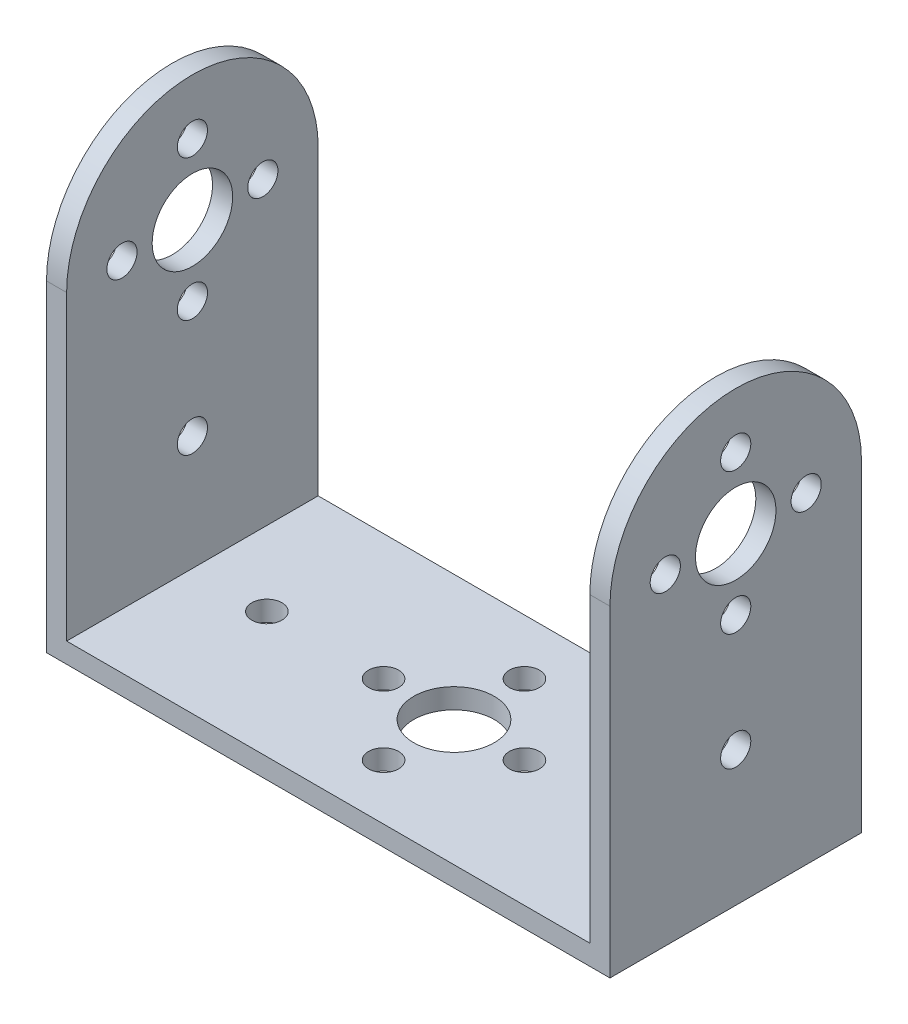
ISO-10303-21;
HEADER;
FILE_DESCRIPTION(('STEP AP214'),'2;1');
FILE_NAME('part.step','',(''),(''),'','','');
FILE_SCHEMA(('AUTOMOTIVE_DESIGN { 1 0 10303 214 1 1 1 1 }'));
ENDSEC;
DATA;
#1=APPLICATION_CONTEXT('core data for automotive mechanical design processes');
#2=APPLICATION_PROTOCOL_DEFINITION('international standard','automotive_design',2000,#1);
#3=PRODUCT_CONTEXT('',#1,'mechanical');
#4=PRODUCT('Part','Part','',(#3));
#5=PRODUCT_RELATED_PRODUCT_CATEGORY('part','',(#4));
#6=PRODUCT_DEFINITION_FORMATION('','',#4);
#7=PRODUCT_DEFINITION_CONTEXT('part definition',#1,'design');
#8=PRODUCT_DEFINITION('design','',#6,#7);
#9=PRODUCT_DEFINITION_SHAPE('','',#8);
#10=(LENGTH_UNIT() NAMED_UNIT(*) SI_UNIT(.MILLI.,.METRE.));
#11=(NAMED_UNIT(*) PLANE_ANGLE_UNIT() SI_UNIT($,.RADIAN.));
#12=(NAMED_UNIT(*) SI_UNIT($,.STERADIAN.) SOLID_ANGLE_UNIT());
#13=UNCERTAINTY_MEASURE_WITH_UNIT(LENGTH_MEASURE(1.E-05),#10,'distance_accuracy_value','');
#14=(GEOMETRIC_REPRESENTATION_CONTEXT(3) GLOBAL_UNCERTAINTY_ASSIGNED_CONTEXT((#13)) GLOBAL_UNIT_ASSIGNED_CONTEXT((#10,
#11,#12)) REPRESENTATION_CONTEXT('',''));
#15=CARTESIAN_POINT('',(0.,0.,0.));
#16=DIRECTION('',(0.,0.,1.));
#17=DIRECTION('',(1.,0.,0.));
#18=AXIS2_PLACEMENT_3D('',#15,#16,#17);
#19=CARTESIAN_POINT('',(25.9999999999998,2.,12.5));
#20=DIRECTION('',(0.,0.,-1.));
#21=DIRECTION('',(-1.,0.,0.));
#22=AXIS2_PLACEMENT_3D('',#19,#20,#21);
#23=PLANE('',#22);
#24=DIRECTION('',(1.,0.,0.));
#25=VECTOR('',#24,1.);
#26=CARTESIAN_POINT('',(25.9999999999998,0.,12.5));
#27=LINE('',#26,#25);
#28=CARTESIAN_POINT('',(-28.0000000000002,0.,12.4999999999999));
#29=VERTEX_POINT('',#28);
#30=CARTESIAN_POINT('',(27.9999999999998,0.,12.5));
#31=VERTEX_POINT('',#30);
#32=EDGE_CURVE('E112',#29,#31,#27,.T.);
#33=ORIENTED_EDGE('',*,*,#32,.T.);
#34=DIRECTION('',(0.,-1.,0.));
#35=VECTOR('',#34,1.);
#36=CARTESIAN_POINT('',(27.9999999999998,0.,12.5));
#37=LINE('',#36,#35);
#38=CARTESIAN_POINT('',(27.9999999999998,32.,12.5));
#39=VERTEX_POINT('',#38);
#40=EDGE_CURVE('E185',#39,#31,#37,.T.);
#41=ORIENTED_EDGE('',*,*,#40,.F.);
#42=DIRECTION('',(-1.,0.,0.));
#43=VECTOR('',#42,1.);
#44=CARTESIAN_POINT('',(27.9999999999998,32.,12.5));
#45=LINE('',#44,#43);
#46=CARTESIAN_POINT('',(25.9999999999998,32.,12.5));
#47=VERTEX_POINT('',#46);
#48=EDGE_CURVE('E194',#39,#47,#45,.T.);
#49=ORIENTED_EDGE('',*,*,#48,.T.);
#50=DIRECTION('',(0.,-1.,0.));
#51=VECTOR('',#50,1.);
#52=CARTESIAN_POINT('',(25.9999999999998,0.,12.5));
#53=LINE('',#52,#51);
#54=CARTESIAN_POINT('',(25.9999999999998,2.,12.5));
#55=VERTEX_POINT('',#54);
#56=EDGE_CURVE('E182',#47,#55,#53,.T.);
#57=ORIENTED_EDGE('',*,*,#56,.T.);
#58=DIRECTION('',(1.,0.,0.));
#59=VECTOR('',#58,1.);
#60=CARTESIAN_POINT('',(25.9999999999998,2.,12.5));
#61=LINE('',#60,#59);
#62=CARTESIAN_POINT('',(-26.0000000000002,2.,12.5));
#63=VERTEX_POINT('',#62);
#64=EDGE_CURVE('E252',#63,#55,#61,.T.);
#65=ORIENTED_EDGE('',*,*,#64,.F.);
#66=DIRECTION('',(0.,1.,0.));
#67=VECTOR('',#66,1.);
#68=CARTESIAN_POINT('',(-26.0000000000002,0.,12.4999999999999));
#69=LINE('',#68,#67);
#70=CARTESIAN_POINT('',(-26.0000000000002,32.,12.4999999999999));
#71=VERTEX_POINT('',#70);
#72=EDGE_CURVE('E59',#63,#71,#69,.T.);
#73=ORIENTED_EDGE('',*,*,#72,.T.);
#74=DIRECTION('',(1.,0.,0.));
#75=VECTOR('',#74,1.);
#76=CARTESIAN_POINT('',(-28.0000000000002,32.,12.4999999999999));
#77=LINE('',#76,#75);
#78=CARTESIAN_POINT('',(-28.0000000000002,32.,12.4999999999999));
#79=VERTEX_POINT('',#78);
#80=EDGE_CURVE('E145',#79,#71,#77,.T.);
#81=ORIENTED_EDGE('',*,*,#80,.F.);
#82=DIRECTION('',(0.,1.,0.));
#83=VECTOR('',#82,1.);
#84=CARTESIAN_POINT('',(-28.0000000000002,0.,12.4999999999999));
#85=LINE('',#84,#83);
#86=EDGE_CURVE('E119',#29,#79,#85,.T.);
#87=ORIENTED_EDGE('',*,*,#86,.F.);
#88=EDGE_LOOP('',(#33,#41,#49,#57,#65,#73,#81,#87));
#89=FACE_BOUND('',#88,.T.);
#90=ADVANCED_FACE('F34',(#89),#23,.F.);
#91=CARTESIAN_POINT('',(25.9999999999998,2.,-12.5000000000001));
#92=DIRECTION('',(0.,0.,1.));
#93=DIRECTION('',(1.,0.,0.));
#94=AXIS2_PLACEMENT_3D('',#91,#92,#93);
#95=PLANE('',#94);
#96=DIRECTION('',(-1.,0.,0.));
#97=VECTOR('',#96,1.);
#98=CARTESIAN_POINT('',(25.9999999999998,0.,-12.5000000000001));
#99=LINE('',#98,#97);
#100=CARTESIAN_POINT('',(27.9999999999998,0.,-12.5));
#101=VERTEX_POINT('',#100);
#102=CARTESIAN_POINT('',(-28.0000000000002,0.,-12.5000000000001));
#103=VERTEX_POINT('',#102);
#104=EDGE_CURVE('E101',#101,#103,#99,.T.);
#105=ORIENTED_EDGE('',*,*,#104,.T.);
#106=DIRECTION('',(0.,-1.,0.));
#107=VECTOR('',#106,1.);
#108=CARTESIAN_POINT('',(-28.0000000000002,0.,-12.5000000000001));
#109=LINE('',#108,#107);
#110=CARTESIAN_POINT('',(-28.0000000000002,32.,-12.5000000000001));
#111=VERTEX_POINT('',#110);
#112=EDGE_CURVE('E106',#111,#103,#109,.T.);
#113=ORIENTED_EDGE('',*,*,#112,.F.);
#114=DIRECTION('',(1.,0.,0.));
#115=VECTOR('',#114,1.);
#116=CARTESIAN_POINT('',(-28.0000000000002,32.,-12.5000000000001));
#117=LINE('',#116,#115);
#118=CARTESIAN_POINT('',(-26.0000000000002,32.,-12.5000000000001));
#119=VERTEX_POINT('',#118);
#120=EDGE_CURVE('E135',#111,#119,#117,.T.);
#121=ORIENTED_EDGE('',*,*,#120,.T.);
#122=DIRECTION('',(0.,-1.,0.));
#123=VECTOR('',#122,1.);
#124=CARTESIAN_POINT('',(-26.0000000000002,0.,-12.5000000000001));
#125=LINE('',#124,#123);
#126=CARTESIAN_POINT('',(-26.0000000000002,2.,-12.5000000000001));
#127=VERTEX_POINT('',#126);
#128=EDGE_CURVE('E140',#119,#127,#125,.T.);
#129=ORIENTED_EDGE('',*,*,#128,.T.);
#130=DIRECTION('',(-1.,0.,0.));
#131=VECTOR('',#130,1.);
#132=CARTESIAN_POINT('',(25.9999999999998,2.,-12.5000000000001));
#133=LINE('',#132,#131);
#134=CARTESIAN_POINT('',(25.9999999999998,2.,-12.5000000000001));
#135=VERTEX_POINT('',#134);
#136=EDGE_CURVE('E11',#135,#127,#133,.T.);
#137=ORIENTED_EDGE('',*,*,#136,.F.);
#138=DIRECTION('',(0.,1.,0.));
#139=VECTOR('',#138,1.);
#140=CARTESIAN_POINT('',(25.9999999999998,0.,-12.5));
#141=LINE('',#140,#139);
#142=CARTESIAN_POINT('',(25.9999999999998,32.,-12.5));
#143=VERTEX_POINT('',#142);
#144=EDGE_CURVE('E51',#135,#143,#141,.T.);
#145=ORIENTED_EDGE('',*,*,#144,.T.);
#146=DIRECTION('',(-1.,0.,0.));
#147=VECTOR('',#146,1.);
#148=CARTESIAN_POINT('',(27.9999999999998,32.,-12.5));
#149=LINE('',#148,#147);
#150=CARTESIAN_POINT('',(27.9999999999998,32.,-12.5));
#151=VERTEX_POINT('',#150);
#152=EDGE_CURVE('E203',#151,#143,#149,.T.);
#153=ORIENTED_EDGE('',*,*,#152,.F.);
#154=DIRECTION('',(0.,1.,0.));
#155=VECTOR('',#154,1.);
#156=CARTESIAN_POINT('',(27.9999999999998,0.,-12.5));
#157=LINE('',#156,#155);
#158=EDGE_CURVE('E108',#101,#151,#157,.T.);
#159=ORIENTED_EDGE('',*,*,#158,.F.);
#160=EDGE_LOOP('',(#105,#113,#121,#129,#137,#145,#153,#159));
#161=FACE_BOUND('',#160,.T.);
#162=ADVANCED_FACE('F103',(#161),#95,.F.);
#163=CARTESIAN_POINT('',(0.,2.,0.));
#164=DIRECTION('',(0.,1.,0.));
#165=DIRECTION('',(0.,0.,1.));
#166=AXIS2_PLACEMENT_3D('',#163,#164,#165);
#167=PLANE('',#166);
#168=CARTESIAN_POINT('',(-18.6,2.,0.));
#169=DIRECTION('',(0.,1.,0.));
#170=DIRECTION('',(0.,0.,1.));
#171=AXIS2_PLACEMENT_3D('',#168,#169,#170);
#172=CIRCLE('',#171,1.5);
#173=CARTESIAN_POINT('',(-18.6,2.,1.5));
#174=VERTEX_POINT('',#173);
#175=EDGE_CURVE('E210',#174,#174,#172,.T.);
#176=ORIENTED_EDGE('',*,*,#175,.F.);
#177=EDGE_LOOP('',(#176));
#178=FACE_BOUND('',#177,.T.);
#179=CARTESIAN_POINT('',(18.6,2.,0.));
#180=DIRECTION('',(0.,1.,0.));
#181=DIRECTION('',(0.,0.,1.));
#182=AXIS2_PLACEMENT_3D('',#179,#180,#181);
#183=CIRCLE('',#182,1.5);
#184=CARTESIAN_POINT('',(18.6,2.,1.5));
#185=VERTEX_POINT('',#184);
#186=EDGE_CURVE('E209',#185,#185,#183,.T.);
#187=ORIENTED_EDGE('',*,*,#186,.F.);
#188=EDGE_LOOP('',(#187));
#189=FACE_BOUND('',#188,.T.);
#190=CARTESIAN_POINT('',(0.,2.,7.));
#191=DIRECTION('',(0.,1.,0.));
#192=DIRECTION('',(0.,0.,1.));
#193=AXIS2_PLACEMENT_3D('',#190,#191,#192);
#194=CIRCLE('',#193,1.5);
#195=CARTESIAN_POINT('',(0.,2.,8.5));
#196=VERTEX_POINT('',#195);
#197=EDGE_CURVE('E216',#196,#196,#194,.T.);
#198=ORIENTED_EDGE('',*,*,#197,.F.);
#199=EDGE_LOOP('',(#198));
#200=FACE_BOUND('',#199,.T.);
#201=CARTESIAN_POINT('',(-7.,2.,0.));
#202=DIRECTION('',(0.,1.,0.));
#203=DIRECTION('',(0.,0.,1.));
#204=AXIS2_PLACEMENT_3D('',#201,#202,#203);
#205=CIRCLE('',#204,1.5);
#206=CARTESIAN_POINT('',(-7.,2.,1.5));
#207=VERTEX_POINT('',#206);
#208=EDGE_CURVE('E222',#207,#207,#205,.T.);
#209=ORIENTED_EDGE('',*,*,#208,.F.);
#210=EDGE_LOOP('',(#209));
#211=FACE_BOUND('',#210,.T.);
#212=CARTESIAN_POINT('',(0.,2.,-7.));
#213=DIRECTION('',(0.,1.,0.));
#214=DIRECTION('',(0.,0.,1.));
#215=AXIS2_PLACEMENT_3D('',#212,#213,#214);
#216=CIRCLE('',#215,1.5);
#217=CARTESIAN_POINT('',(0.,2.,-5.5));
#218=VERTEX_POINT('',#217);
#219=EDGE_CURVE('E228',#218,#218,#216,.T.);
#220=ORIENTED_EDGE('',*,*,#219,.F.);
#221=EDGE_LOOP('',(#220));
#222=FACE_BOUND('',#221,.T.);
#223=CARTESIAN_POINT('',(7.,2.,0.));
#224=DIRECTION('',(0.,1.,0.));
#225=DIRECTION('',(0.,0.,1.));
#226=AXIS2_PLACEMENT_3D('',#223,#224,#225);
#227=CIRCLE('',#226,1.5);
#228=CARTESIAN_POINT('',(7.,2.,1.5));
#229=VERTEX_POINT('',#228);
#230=EDGE_CURVE('E234',#229,#229,#227,.T.);
#231=ORIENTED_EDGE('',*,*,#230,.F.);
#232=EDGE_LOOP('',(#231));
#233=FACE_BOUND('',#232,.T.);
#234=CARTESIAN_POINT('',(0.,2.,0.));
#235=DIRECTION('',(0.,1.,0.));
#236=DIRECTION('',(0.,0.,1.));
#237=AXIS2_PLACEMENT_3D('',#234,#235,#236);
#238=CIRCLE('',#237,4.);
#239=CARTESIAN_POINT('',(0.,2.,4.));
#240=VERTEX_POINT('',#239);
#241=EDGE_CURVE('E240',#240,#240,#238,.T.);
#242=ORIENTED_EDGE('',*,*,#241,.F.);
#243=EDGE_LOOP('',(#242));
#244=FACE_BOUND('',#243,.T.);
#245=DIRECTION('',(0.,0.,1.));
#246=VECTOR('',#245,1.);
#247=CARTESIAN_POINT('',(-26.0000000000002,2.,12.5));
#248=LINE('',#247,#246);
#249=EDGE_CURVE('E37',#127,#63,#248,.T.);
#250=ORIENTED_EDGE('',*,*,#249,.T.);
#251=ORIENTED_EDGE('',*,*,#64,.T.);
#252=DIRECTION('',(0.,0.,-1.));
#253=VECTOR('',#252,1.);
#254=CARTESIAN_POINT('',(25.9999999999998,2.,12.5));
#255=LINE('',#254,#253);
#256=EDGE_CURVE('E43',#55,#135,#255,.T.);
#257=ORIENTED_EDGE('',*,*,#256,.T.);
#258=ORIENTED_EDGE('',*,*,#136,.T.);
#259=EDGE_LOOP('',(#250,#251,#257,#258));
#260=FACE_BOUND('',#259,.T.);
#261=ADVANCED_FACE('F260',(#178,#189,#200,#211,#222,#233,#244,#260),#167,.T.);
#262=CARTESIAN_POINT('',(0.,0.,0.));
#263=DIRECTION('',(0.,1.,0.));
#264=DIRECTION('',(0.,0.,1.));
#265=AXIS2_PLACEMENT_3D('',#262,#263,#264);
#266=PLANE('',#265);
#267=CARTESIAN_POINT('',(-18.6,0.,0.));
#268=DIRECTION('',(0.,1.,0.));
#269=DIRECTION('',(0.,0.,1.));
#270=AXIS2_PLACEMENT_3D('',#267,#268,#269);
#271=CIRCLE('',#270,1.5);
#272=CARTESIAN_POINT('',(-18.6,0.,1.5));
#273=VERTEX_POINT('',#272);
#274=EDGE_CURVE('E206',#273,#273,#271,.T.);
#275=ORIENTED_EDGE('',*,*,#274,.T.);
#276=EDGE_LOOP('',(#275));
#277=FACE_BOUND('',#276,.T.);
#278=CARTESIAN_POINT('',(18.6,0.,0.));
#279=DIRECTION('',(0.,1.,0.));
#280=DIRECTION('',(0.,0.,1.));
#281=AXIS2_PLACEMENT_3D('',#278,#279,#280);
#282=CIRCLE('',#281,1.5);
#283=CARTESIAN_POINT('',(18.6,0.,1.5));
#284=VERTEX_POINT('',#283);
#285=EDGE_CURVE('E213',#284,#284,#282,.T.);
#286=ORIENTED_EDGE('',*,*,#285,.T.);
#287=EDGE_LOOP('',(#286));
#288=FACE_BOUND('',#287,.T.);
#289=CARTESIAN_POINT('',(0.,0.,7.));
#290=DIRECTION('',(0.,1.,0.));
#291=DIRECTION('',(0.,0.,1.));
#292=AXIS2_PLACEMENT_3D('',#289,#290,#291);
#293=CIRCLE('',#292,1.5);
#294=CARTESIAN_POINT('',(0.,0.,8.5));
#295=VERTEX_POINT('',#294);
#296=EDGE_CURVE('E219',#295,#295,#293,.T.);
#297=ORIENTED_EDGE('',*,*,#296,.T.);
#298=EDGE_LOOP('',(#297));
#299=FACE_BOUND('',#298,.T.);
#300=CARTESIAN_POINT('',(-7.,0.,0.));
#301=DIRECTION('',(0.,1.,0.));
#302=DIRECTION('',(0.,0.,1.));
#303=AXIS2_PLACEMENT_3D('',#300,#301,#302);
#304=CIRCLE('',#303,1.5);
#305=CARTESIAN_POINT('',(-7.,0.,1.5));
#306=VERTEX_POINT('',#305);
#307=EDGE_CURVE('E225',#306,#306,#304,.T.);
#308=ORIENTED_EDGE('',*,*,#307,.T.);
#309=EDGE_LOOP('',(#308));
#310=FACE_BOUND('',#309,.T.);
#311=CARTESIAN_POINT('',(0.,0.,-7.));
#312=DIRECTION('',(0.,1.,0.));
#313=DIRECTION('',(0.,0.,1.));
#314=AXIS2_PLACEMENT_3D('',#311,#312,#313);
#315=CIRCLE('',#314,1.5);
#316=CARTESIAN_POINT('',(0.,0.,-5.5));
#317=VERTEX_POINT('',#316);
#318=EDGE_CURVE('E231',#317,#317,#315,.T.);
#319=ORIENTED_EDGE('',*,*,#318,.T.);
#320=EDGE_LOOP('',(#319));
#321=FACE_BOUND('',#320,.T.);
#322=CARTESIAN_POINT('',(7.,0.,0.));
#323=DIRECTION('',(0.,1.,0.));
#324=DIRECTION('',(0.,0.,1.));
#325=AXIS2_PLACEMENT_3D('',#322,#323,#324);
#326=CIRCLE('',#325,1.5);
#327=CARTESIAN_POINT('',(7.,0.,1.5));
#328=VERTEX_POINT('',#327);
#329=EDGE_CURVE('E237',#328,#328,#326,.T.);
#330=ORIENTED_EDGE('',*,*,#329,.T.);
#331=EDGE_LOOP('',(#330));
#332=FACE_BOUND('',#331,.T.);
#333=CARTESIAN_POINT('',(0.,0.,0.));
#334=DIRECTION('',(0.,1.,0.));
#335=DIRECTION('',(0.,0.,1.));
#336=AXIS2_PLACEMENT_3D('',#333,#334,#335);
#337=CIRCLE('',#336,4.);
#338=CARTESIAN_POINT('',(0.,0.,4.));
#339=VERTEX_POINT('',#338);
#340=EDGE_CURVE('E243',#339,#339,#337,.T.);
#341=ORIENTED_EDGE('',*,*,#340,.T.);
#342=EDGE_LOOP('',(#341));
#343=FACE_BOUND('',#342,.T.);
#344=ORIENTED_EDGE('',*,*,#32,.F.);
#345=DIRECTION('',(0.,0.,1.));
#346=VECTOR('',#345,1.);
#347=CARTESIAN_POINT('',(-28.0000000000002,0.,-12.5000000000001));
#348=LINE('',#347,#346);
#349=EDGE_CURVE('E115',#103,#29,#348,.T.);
#350=ORIENTED_EDGE('',*,*,#349,.F.);
#351=ORIENTED_EDGE('',*,*,#104,.F.);
#352=DIRECTION('',(0.,0.,-1.));
#353=VECTOR('',#352,1.);
#354=CARTESIAN_POINT('',(27.9999999999998,0.,12.5));
#355=LINE('',#354,#353);
#356=EDGE_CURVE('E188',#31,#101,#355,.T.);
#357=ORIENTED_EDGE('',*,*,#356,.F.);
#358=EDGE_LOOP('',(#344,#350,#351,#357));
#359=FACE_BOUND('',#358,.T.);
#360=ADVANCED_FACE('F116',(#277,#288,#299,#310,#321,#332,#343,#359),#266,.F.);
#361=CARTESIAN_POINT('',(0.,0.,0.));
#362=DIRECTION('',(0.,1.,0.));
#363=DIRECTION('',(0.,0.,1.));
#364=AXIS2_PLACEMENT_3D('',#361,#362,#363);
#365=CYLINDRICAL_SURFACE('',#364,4.);
#366=ORIENTED_EDGE('',*,*,#340,.F.);
#367=EDGE_LOOP('',(#366));
#368=FACE_BOUND('',#367,.T.);
#369=ORIENTED_EDGE('',*,*,#241,.T.);
#370=EDGE_LOOP('',(#369));
#371=FACE_BOUND('',#370,.T.);
#372=ADVANCED_FACE('F332',(#368,#371),#365,.F.);
#373=CARTESIAN_POINT('',(7.,0.,0.));
#374=DIRECTION('',(0.,1.,0.));
#375=DIRECTION('',(0.,0.,1.));
#376=AXIS2_PLACEMENT_3D('',#373,#374,#375);
#377=CYLINDRICAL_SURFACE('',#376,1.5);
#378=ORIENTED_EDGE('',*,*,#329,.F.);
#379=EDGE_LOOP('',(#378));
#380=FACE_BOUND('',#379,.T.);
#381=ORIENTED_EDGE('',*,*,#230,.T.);
#382=EDGE_LOOP('',(#381));
#383=FACE_BOUND('',#382,.T.);
#384=ADVANCED_FACE('F337',(#380,#383),#377,.F.);
#385=CARTESIAN_POINT('',(0.,0.,-7.));
#386=DIRECTION('',(0.,1.,0.));
#387=DIRECTION('',(0.,0.,1.));
#388=AXIS2_PLACEMENT_3D('',#385,#386,#387);
#389=CYLINDRICAL_SURFACE('',#388,1.5);
#390=ORIENTED_EDGE('',*,*,#318,.F.);
#391=EDGE_LOOP('',(#390));
#392=FACE_BOUND('',#391,.T.);
#393=ORIENTED_EDGE('',*,*,#219,.T.);
#394=EDGE_LOOP('',(#393));
#395=FACE_BOUND('',#394,.T.);
#396=ADVANCED_FACE('F341',(#392,#395),#389,.F.);
#397=CARTESIAN_POINT('',(-7.,0.,0.));
#398=DIRECTION('',(0.,1.,0.));
#399=DIRECTION('',(0.,0.,1.));
#400=AXIS2_PLACEMENT_3D('',#397,#398,#399);
#401=CYLINDRICAL_SURFACE('',#400,1.5);
#402=ORIENTED_EDGE('',*,*,#307,.F.);
#403=EDGE_LOOP('',(#402));
#404=FACE_BOUND('',#403,.T.);
#405=ORIENTED_EDGE('',*,*,#208,.T.);
#406=EDGE_LOOP('',(#405));
#407=FACE_BOUND('',#406,.T.);
#408=ADVANCED_FACE('F345',(#404,#407),#401,.F.);
#409=CARTESIAN_POINT('',(0.,0.,7.));
#410=DIRECTION('',(0.,1.,0.));
#411=DIRECTION('',(0.,0.,1.));
#412=AXIS2_PLACEMENT_3D('',#409,#410,#411);
#413=CYLINDRICAL_SURFACE('',#412,1.5);
#414=ORIENTED_EDGE('',*,*,#296,.F.);
#415=EDGE_LOOP('',(#414));
#416=FACE_BOUND('',#415,.T.);
#417=ORIENTED_EDGE('',*,*,#197,.T.);
#418=EDGE_LOOP('',(#417));
#419=FACE_BOUND('',#418,.T.);
#420=ADVANCED_FACE('F349',(#416,#419),#413,.F.);
#421=CARTESIAN_POINT('',(18.6,0.,0.));
#422=DIRECTION('',(0.,1.,0.));
#423=DIRECTION('',(0.,0.,1.));
#424=AXIS2_PLACEMENT_3D('',#421,#422,#423);
#425=CYLINDRICAL_SURFACE('',#424,1.5);
#426=ORIENTED_EDGE('',*,*,#285,.F.);
#427=EDGE_LOOP('',(#426));
#428=FACE_BOUND('',#427,.T.);
#429=ORIENTED_EDGE('',*,*,#186,.T.);
#430=EDGE_LOOP('',(#429));
#431=FACE_BOUND('',#430,.T.);
#432=ADVANCED_FACE('F353',(#428,#431),#425,.F.);
#433=CARTESIAN_POINT('',(-18.6,0.,0.));
#434=DIRECTION('',(0.,1.,0.));
#435=DIRECTION('',(0.,0.,1.));
#436=AXIS2_PLACEMENT_3D('',#433,#434,#435);
#437=CYLINDRICAL_SURFACE('',#436,1.5);
#438=ORIENTED_EDGE('',*,*,#274,.F.);
#439=EDGE_LOOP('',(#438));
#440=FACE_BOUND('',#439,.T.);
#441=ORIENTED_EDGE('',*,*,#175,.T.);
#442=EDGE_LOOP('',(#441));
#443=FACE_BOUND('',#442,.T.);
#444=ADVANCED_FACE('F299',(#440,#443),#437,.F.);
#445=CARTESIAN_POINT('',(25.9999999999998,32.,0.));
#446=DIRECTION('',(-1.,0.,0.));
#447=DIRECTION('',(0.,0.,1.));
#448=AXIS2_PLACEMENT_3D('',#445,#446,#447);
#449=PLANE('',#448);
#450=CARTESIAN_POINT('',(25.9999999999998,13.4,0.));
#451=DIRECTION('',(1.,0.,0.));
#452=DIRECTION('',(0.,0.,-1.));
#453=AXIS2_PLACEMENT_3D('',#450,#451,#452);
#454=CIRCLE('',#453,1.5);
#455=CARTESIAN_POINT('',(25.9999999999998,13.4,-1.50000000000005));
#456=VERTEX_POINT('',#455);
#457=EDGE_CURVE('E152',#456,#456,#454,.T.);
#458=ORIENTED_EDGE('',*,*,#457,.T.);
#459=EDGE_LOOP('',(#458));
#460=FACE_BOUND('',#459,.T.);
#461=CARTESIAN_POINT('',(25.9999999999998,25.,0.));
#462=DIRECTION('',(1.,0.,0.));
#463=DIRECTION('',(0.,0.,-1.));
#464=AXIS2_PLACEMENT_3D('',#461,#462,#463);
#465=CIRCLE('',#464,1.5);
#466=CARTESIAN_POINT('',(25.9999999999998,25.,-1.50000000000005));
#467=VERTEX_POINT('',#466);
#468=EDGE_CURVE('E158',#467,#467,#465,.T.);
#469=ORIENTED_EDGE('',*,*,#468,.T.);
#470=EDGE_LOOP('',(#469));
#471=FACE_BOUND('',#470,.T.);
#472=CARTESIAN_POINT('',(25.9999999999998,39.,0.));
#473=DIRECTION('',(1.,0.,0.));
#474=DIRECTION('',(0.,0.,-1.));
#475=AXIS2_PLACEMENT_3D('',#472,#473,#474);
#476=CIRCLE('',#475,1.5);
#477=CARTESIAN_POINT('',(25.9999999999998,39.,-1.50000000000005));
#478=VERTEX_POINT('',#477);
#479=EDGE_CURVE('E170',#478,#478,#476,.T.);
#480=ORIENTED_EDGE('',*,*,#479,.T.);
#481=EDGE_LOOP('',(#480));
#482=FACE_BOUND('',#481,.T.);
#483=CARTESIAN_POINT('',(25.9999999999998,32.,0.));
#484=DIRECTION('',(1.,0.,0.));
#485=DIRECTION('',(0.,0.,-1.));
#486=AXIS2_PLACEMENT_3D('',#483,#484,#485);
#487=CIRCLE('',#486,4.);
#488=CARTESIAN_POINT('',(25.9999999999998,32.,-4.00000000000005));
#489=VERTEX_POINT('',#488);
#490=EDGE_CURVE('E176',#489,#489,#487,.T.);
#491=ORIENTED_EDGE('',*,*,#490,.T.);
#492=EDGE_LOOP('',(#491));
#493=FACE_BOUND('',#492,.T.);
#494=CARTESIAN_POINT('',(25.9999999999998,32.,-7.00000000000005));
#495=DIRECTION('',(1.,0.,0.));
#496=DIRECTION('',(0.,0.,-1.));
#497=AXIS2_PLACEMENT_3D('',#494,#495,#496);
#498=CIRCLE('',#497,1.5);
#499=CARTESIAN_POINT('',(25.9999999999998,32.,-8.50000000000005));
#500=VERTEX_POINT('',#499);
#501=EDGE_CURVE('E164',#500,#500,#498,.T.);
#502=ORIENTED_EDGE('',*,*,#501,.T.);
#503=EDGE_LOOP('',(#502));
#504=FACE_BOUND('',#503,.T.);
#505=CARTESIAN_POINT('',(25.9999999999998,32.,6.99999999999995));
#506=DIRECTION('',(1.,0.,0.));
#507=DIRECTION('',(0.,0.,-1.));
#508=AXIS2_PLACEMENT_3D('',#505,#506,#507);
#509=CIRCLE('',#508,1.5);
#510=CARTESIAN_POINT('',(25.9999999999998,32.,5.49999999999995));
#511=VERTEX_POINT('',#510);
#512=EDGE_CURVE('E151',#511,#511,#509,.T.);
#513=ORIENTED_EDGE('',*,*,#512,.T.);
#514=EDGE_LOOP('',(#513));
#515=FACE_BOUND('',#514,.T.);
#516=ORIENTED_EDGE('',*,*,#256,.F.);
#517=ORIENTED_EDGE('',*,*,#56,.F.);
#518=CARTESIAN_POINT('',(25.9999999999998,32.,0.));
#519=DIRECTION('',(1.,0.,0.));
#520=DIRECTION('',(0.,0.,1.));
#521=AXIS2_PLACEMENT_3D('',#518,#519,#520);
#522=CIRCLE('',#521,12.5);
#523=EDGE_CURVE('E189',#143,#47,#522,.T.);
#524=ORIENTED_EDGE('',*,*,#523,.F.);
#525=ORIENTED_EDGE('',*,*,#144,.F.);
#526=EDGE_LOOP('',(#516,#517,#524,#525));
#527=FACE_BOUND('',#526,.T.);
#528=ADVANCED_FACE('F273',(#460,#471,#482,#493,#504,#515,#527),#449,.T.);
#529=CARTESIAN_POINT('',(27.9999999999998,32.,0.));
#530=DIRECTION('',(-1.,0.,0.));
#531=DIRECTION('',(0.,0.,1.));
#532=AXIS2_PLACEMENT_3D('',#529,#530,#531);
#533=PLANE('',#532);
#534=CARTESIAN_POINT('',(27.9999999999998,32.,6.99999999999995));
#535=DIRECTION('',(1.,0.,0.));
#536=DIRECTION('',(0.,0.,-1.));
#537=AXIS2_PLACEMENT_3D('',#534,#535,#536);
#538=CIRCLE('',#537,1.5);
#539=CARTESIAN_POINT('',(27.9999999999998,32.,5.49999999999995));
#540=VERTEX_POINT('',#539);
#541=EDGE_CURVE('E155',#540,#540,#538,.T.);
#542=ORIENTED_EDGE('',*,*,#541,.F.);
#543=EDGE_LOOP('',(#542));
#544=FACE_BOUND('',#543,.T.);
#545=CARTESIAN_POINT('',(27.9999999999998,32.,-7.00000000000005));
#546=DIRECTION('',(1.,0.,0.));
#547=DIRECTION('',(0.,0.,-1.));
#548=AXIS2_PLACEMENT_3D('',#545,#546,#547);
#549=CIRCLE('',#548,1.5);
#550=CARTESIAN_POINT('',(27.9999999999998,32.,-8.50000000000005));
#551=VERTEX_POINT('',#550);
#552=EDGE_CURVE('E167',#551,#551,#549,.T.);
#553=ORIENTED_EDGE('',*,*,#552,.F.);
#554=EDGE_LOOP('',(#553));
#555=FACE_BOUND('',#554,.T.);
#556=CARTESIAN_POINT('',(27.9999999999998,32.,0.));
#557=DIRECTION('',(1.,0.,0.));
#558=DIRECTION('',(0.,0.,-1.));
#559=AXIS2_PLACEMENT_3D('',#556,#557,#558);
#560=CIRCLE('',#559,4.);
#561=CARTESIAN_POINT('',(27.9999999999998,32.,-4.00000000000005));
#562=VERTEX_POINT('',#561);
#563=EDGE_CURVE('E179',#562,#562,#560,.T.);
#564=ORIENTED_EDGE('',*,*,#563,.F.);
#565=EDGE_LOOP('',(#564));
#566=FACE_BOUND('',#565,.T.);
#567=ORIENTED_EDGE('',*,*,#40,.T.);
#568=ORIENTED_EDGE('',*,*,#356,.T.);
#569=ORIENTED_EDGE('',*,*,#158,.T.);
#570=CARTESIAN_POINT('',(27.9999999999998,32.,0.));
#571=DIRECTION('',(1.,0.,0.));
#572=DIRECTION('',(0.,0.,1.));
#573=AXIS2_PLACEMENT_3D('',#570,#571,#572);
#574=CIRCLE('',#573,12.5);
#575=EDGE_CURVE('E192',#151,#39,#574,.T.);
#576=ORIENTED_EDGE('',*,*,#575,.T.);
#577=EDGE_LOOP('',(#567,#568,#569,#576));
#578=FACE_BOUND('',#577,.T.);
#579=CARTESIAN_POINT('',(27.9999999999998,39.,0.));
#580=DIRECTION('',(1.,0.,0.));
#581=DIRECTION('',(0.,0.,-1.));
#582=AXIS2_PLACEMENT_3D('',#579,#580,#581);
#583=CIRCLE('',#582,1.5);
#584=CARTESIAN_POINT('',(27.9999999999998,39.,-1.50000000000005));
#585=VERTEX_POINT('',#584);
#586=EDGE_CURVE('E173',#585,#585,#583,.T.);
#587=ORIENTED_EDGE('',*,*,#586,.F.);
#588=EDGE_LOOP('',(#587));
#589=FACE_BOUND('',#588,.T.);
#590=CARTESIAN_POINT('',(27.9999999999998,25.,0.));
#591=DIRECTION('',(1.,0.,0.));
#592=DIRECTION('',(0.,0.,-1.));
#593=AXIS2_PLACEMENT_3D('',#590,#591,#592);
#594=CIRCLE('',#593,1.5);
#595=CARTESIAN_POINT('',(27.9999999999998,25.,-1.50000000000005));
#596=VERTEX_POINT('',#595);
#597=EDGE_CURVE('E161',#596,#596,#594,.T.);
#598=ORIENTED_EDGE('',*,*,#597,.F.);
#599=EDGE_LOOP('',(#598));
#600=FACE_BOUND('',#599,.T.);
#601=CARTESIAN_POINT('',(27.9999999999998,13.4,0.));
#602=DIRECTION('',(1.,0.,0.));
#603=DIRECTION('',(0.,0.,-1.));
#604=AXIS2_PLACEMENT_3D('',#601,#602,#603);
#605=CIRCLE('',#604,1.5);
#606=CARTESIAN_POINT('',(27.9999999999998,13.4,-1.50000000000005));
#607=VERTEX_POINT('',#606);
#608=EDGE_CURVE('E148',#607,#607,#605,.T.);
#609=ORIENTED_EDGE('',*,*,#608,.F.);
#610=EDGE_LOOP('',(#609));
#611=FACE_BOUND('',#610,.T.);
#612=ADVANCED_FACE('F279',(#544,#555,#566,#578,#589,#600,#611),#533,.F.);
#613=CARTESIAN_POINT('',(27.9999999999998,32.,0.));
#614=DIRECTION('',(-1.,0.,0.));
#615=DIRECTION('',(0.,0.,1.));
#616=AXIS2_PLACEMENT_3D('',#613,#614,#615);
#617=CYLINDRICAL_SURFACE('',#616,12.5);
#618=ORIENTED_EDGE('',*,*,#523,.T.);
#619=ORIENTED_EDGE('',*,*,#48,.F.);
#620=ORIENTED_EDGE('',*,*,#575,.F.);
#621=ORIENTED_EDGE('',*,*,#152,.T.);
#622=EDGE_LOOP('',(#618,#619,#620,#621));
#623=FACE_BOUND('',#622,.T.);
#624=ADVANCED_FACE('F277',(#623),#617,.T.);
#625=CARTESIAN_POINT('',(27.9999999999998,32.,0.));
#626=DIRECTION('',(-1.,0.,0.));
#627=DIRECTION('',(0.,0.,1.));
#628=AXIS2_PLACEMENT_3D('',#625,#626,#627);
#629=CYLINDRICAL_SURFACE('',#628,4.);
#630=ORIENTED_EDGE('',*,*,#563,.T.);
#631=EDGE_LOOP('',(#630));
#632=FACE_BOUND('',#631,.T.);
#633=ORIENTED_EDGE('',*,*,#490,.F.);
#634=EDGE_LOOP('',(#633));
#635=FACE_BOUND('',#634,.T.);
#636=ADVANCED_FACE('F362',(#632,#635),#629,.F.);
#637=CARTESIAN_POINT('',(27.9999999999998,39.,0.));
#638=DIRECTION('',(-1.,0.,0.));
#639=DIRECTION('',(0.,0.,1.));
#640=AXIS2_PLACEMENT_3D('',#637,#638,#639);
#641=CYLINDRICAL_SURFACE('',#640,1.5);
#642=ORIENTED_EDGE('',*,*,#586,.T.);
#643=EDGE_LOOP('',(#642));
#644=FACE_BOUND('',#643,.T.);
#645=ORIENTED_EDGE('',*,*,#479,.F.);
#646=EDGE_LOOP('',(#645));
#647=FACE_BOUND('',#646,.T.);
#648=ADVANCED_FACE('F366',(#644,#647),#641,.F.);
#649=CARTESIAN_POINT('',(27.9999999999998,32.,-7.00000000000005));
#650=DIRECTION('',(-1.,0.,0.));
#651=DIRECTION('',(0.,0.,1.));
#652=AXIS2_PLACEMENT_3D('',#649,#650,#651);
#653=CYLINDRICAL_SURFACE('',#652,1.5);
#654=ORIENTED_EDGE('',*,*,#552,.T.);
#655=EDGE_LOOP('',(#654));
#656=FACE_BOUND('',#655,.T.);
#657=ORIENTED_EDGE('',*,*,#501,.F.);
#658=EDGE_LOOP('',(#657));
#659=FACE_BOUND('',#658,.T.);
#660=ADVANCED_FACE('F318',(#656,#659),#653,.F.);
#661=CARTESIAN_POINT('',(27.9999999999998,25.,0.));
#662=DIRECTION('',(-1.,0.,0.));
#663=DIRECTION('',(0.,0.,1.));
#664=AXIS2_PLACEMENT_3D('',#661,#662,#663);
#665=CYLINDRICAL_SURFACE('',#664,1.5);
#666=ORIENTED_EDGE('',*,*,#597,.T.);
#667=EDGE_LOOP('',(#666));
#668=FACE_BOUND('',#667,.T.);
#669=ORIENTED_EDGE('',*,*,#468,.F.);
#670=EDGE_LOOP('',(#669));
#671=FACE_BOUND('',#670,.T.);
#672=ADVANCED_FACE('F312',(#668,#671),#665,.F.);
#673=CARTESIAN_POINT('',(27.9999999999998,32.,6.99999999999995));
#674=DIRECTION('',(-1.,0.,0.));
#675=DIRECTION('',(0.,0.,1.));
#676=AXIS2_PLACEMENT_3D('',#673,#674,#675);
#677=CYLINDRICAL_SURFACE('',#676,1.5);
#678=ORIENTED_EDGE('',*,*,#541,.T.);
#679=EDGE_LOOP('',(#678));
#680=FACE_BOUND('',#679,.T.);
#681=ORIENTED_EDGE('',*,*,#512,.F.);
#682=EDGE_LOOP('',(#681));
#683=FACE_BOUND('',#682,.T.);
#684=ADVANCED_FACE('F293',(#680,#683),#677,.F.);
#685=CARTESIAN_POINT('',(27.9999999999998,13.4,0.));
#686=DIRECTION('',(-1.,0.,0.));
#687=DIRECTION('',(0.,0.,1.));
#688=AXIS2_PLACEMENT_3D('',#685,#686,#687);
#689=CYLINDRICAL_SURFACE('',#688,1.5);
#690=ORIENTED_EDGE('',*,*,#608,.T.);
#691=EDGE_LOOP('',(#690));
#692=FACE_BOUND('',#691,.T.);
#693=ORIENTED_EDGE('',*,*,#457,.F.);
#694=EDGE_LOOP('',(#693));
#695=FACE_BOUND('',#694,.T.);
#696=ADVANCED_FACE('F290',(#692,#695),#689,.F.);
#697=CARTESIAN_POINT('',(-26.0000000000002,32.,0.));
#698=DIRECTION('',(1.,0.,0.));
#699=DIRECTION('',(0.,0.,-1.));
#700=AXIS2_PLACEMENT_3D('',#697,#698,#699);
#701=PLANE('',#700);
#702=CARTESIAN_POINT('',(-26.0000000000002,13.4,0.));
#703=DIRECTION('',(-1.,0.,0.));
#704=DIRECTION('',(0.,0.,1.));
#705=AXIS2_PLACEMENT_3D('',#702,#703,#704);
#706=CIRCLE('',#705,1.5);
#707=CARTESIAN_POINT('',(-26.0000000000002,13.4,1.49999999999996));
#708=VERTEX_POINT('',#707);
#709=EDGE_CURVE('E518',#708,#708,#706,.T.);
#710=ORIENTED_EDGE('',*,*,#709,.T.);
#711=EDGE_LOOP('',(#710));
#712=FACE_BOUND('',#711,.T.);
#713=CARTESIAN_POINT('',(-26.0000000000002,25.,0.));
#714=DIRECTION('',(-1.,0.,0.));
#715=DIRECTION('',(0.,0.,1.));
#716=AXIS2_PLACEMENT_3D('',#713,#714,#715);
#717=CIRCLE('',#716,1.5);
#718=CARTESIAN_POINT('',(-26.0000000000002,25.,1.49999999999995));
#719=VERTEX_POINT('',#718);
#720=EDGE_CURVE('E526',#719,#719,#717,.T.);
#721=ORIENTED_EDGE('',*,*,#720,.T.);
#722=EDGE_LOOP('',(#721));
#723=FACE_BOUND('',#722,.T.);
#724=CARTESIAN_POINT('',(-26.0000000000002,39.,0.));
#725=DIRECTION('',(-1.,0.,0.));
#726=DIRECTION('',(0.,0.,1.));
#727=AXIS2_PLACEMENT_3D('',#724,#725,#726);
#728=CIRCLE('',#727,1.49633998204764);
#729=CARTESIAN_POINT('',(-26.0000000000002,39.,1.4963399820476));
#730=VERTEX_POINT('',#729);
#731=EDGE_CURVE('E538',#730,#730,#728,.T.);
#732=ORIENTED_EDGE('',*,*,#731,.T.);
#733=EDGE_LOOP('',(#732));
#734=FACE_BOUND('',#733,.T.);
#735=CARTESIAN_POINT('',(-26.0000000000002,32.,0.));
#736=DIRECTION('',(-1.,0.,0.));
#737=DIRECTION('',(0.,0.,1.));
#738=AXIS2_PLACEMENT_3D('',#735,#736,#737);
#739=CIRCLE('',#738,3.99999999999999);
#740=CARTESIAN_POINT('',(-26.0000000000002,32.,3.99999999999992));
#741=VERTEX_POINT('',#740);
#742=EDGE_CURVE('E130',#741,#741,#739,.T.);
#743=ORIENTED_EDGE('',*,*,#742,.T.);
#744=EDGE_LOOP('',(#743));
#745=FACE_BOUND('',#744,.T.);
#746=CARTESIAN_POINT('',(-26.0000000000002,32.,6.99999999999995));
#747=DIRECTION('',(-1.,0.,0.));
#748=DIRECTION('',(0.,0.,1.));
#749=AXIS2_PLACEMENT_3D('',#746,#747,#748);
#750=CIRCLE('',#749,1.5);
#751=CARTESIAN_POINT('',(-26.0000000000002,32.,8.49999999999996));
#752=VERTEX_POINT('',#751);
#753=EDGE_CURVE('E532',#752,#752,#750,.T.);
#754=ORIENTED_EDGE('',*,*,#753,.T.);
#755=EDGE_LOOP('',(#754));
#756=FACE_BOUND('',#755,.T.);
#757=CARTESIAN_POINT('',(-26.0000000000002,32.,-7.00000000000005));
#758=DIRECTION('',(-1.,0.,0.));
#759=DIRECTION('',(0.,0.,1.));
#760=AXIS2_PLACEMENT_3D('',#757,#758,#759);
#761=CIRCLE('',#760,1.5);
#762=CARTESIAN_POINT('',(-26.0000000000002,32.,-5.50000000000004));
#763=VERTEX_POINT('',#762);
#764=EDGE_CURVE('E520',#763,#763,#761,.T.);
#765=ORIENTED_EDGE('',*,*,#764,.T.);
#766=EDGE_LOOP('',(#765));
#767=FACE_BOUND('',#766,.T.);
#768=ORIENTED_EDGE('',*,*,#249,.F.);
#769=ORIENTED_EDGE('',*,*,#128,.F.);
#770=CARTESIAN_POINT('',(-26.0000000000002,32.,0.));
#771=DIRECTION('',(-1.,0.,0.));
#772=DIRECTION('',(0.,0.,-1.));
#773=AXIS2_PLACEMENT_3D('',#770,#771,#772);
#774=CIRCLE('',#773,12.5);
#775=EDGE_CURVE('E126',#71,#119,#774,.T.);
#776=ORIENTED_EDGE('',*,*,#775,.F.);
#777=ORIENTED_EDGE('',*,*,#72,.F.);
#778=EDGE_LOOP('',(#768,#769,#776,#777));
#779=FACE_BOUND('',#778,.T.);
#780=ADVANCED_FACE('F263',(#712,#723,#734,#745,#756,#767,#779),#701,.T.);
#781=CARTESIAN_POINT('',(-28.0000000000002,32.,0.));
#782=DIRECTION('',(1.,0.,0.));
#783=DIRECTION('',(0.,0.,-1.));
#784=AXIS2_PLACEMENT_3D('',#781,#782,#783);
#785=PLANE('',#784);
#786=CARTESIAN_POINT('',(-28.0000000000002,32.,-7.00000000000005));
#787=DIRECTION('',(-1.,0.,0.));
#788=DIRECTION('',(0.,0.,1.));
#789=AXIS2_PLACEMENT_3D('',#786,#787,#788);
#790=CIRCLE('',#789,1.5);
#791=CARTESIAN_POINT('',(-28.0000000000002,32.,-5.50000000000004));
#792=VERTEX_POINT('',#791);
#793=EDGE_CURVE('E523',#792,#792,#790,.T.);
#794=ORIENTED_EDGE('',*,*,#793,.F.);
#795=EDGE_LOOP('',(#794));
#796=FACE_BOUND('',#795,.T.);
#797=CARTESIAN_POINT('',(-28.0000000000002,32.,6.99999999999995));
#798=DIRECTION('',(-1.,0.,0.));
#799=DIRECTION('',(0.,0.,1.));
#800=AXIS2_PLACEMENT_3D('',#797,#798,#799);
#801=CIRCLE('',#800,1.5);
#802=CARTESIAN_POINT('',(-28.0000000000002,32.,8.49999999999996));
#803=VERTEX_POINT('',#802);
#804=EDGE_CURVE('E535',#803,#803,#801,.T.);
#805=ORIENTED_EDGE('',*,*,#804,.F.);
#806=EDGE_LOOP('',(#805));
#807=FACE_BOUND('',#806,.T.);
#808=CARTESIAN_POINT('',(-28.0000000000002,32.,0.));
#809=DIRECTION('',(-1.,0.,0.));
#810=DIRECTION('',(0.,0.,1.));
#811=AXIS2_PLACEMENT_3D('',#808,#809,#810);
#812=CIRCLE('',#811,3.99999999999999);
#813=CARTESIAN_POINT('',(-28.0000000000002,32.,3.99999999999992));
#814=VERTEX_POINT('',#813);
#815=EDGE_CURVE('E144',#814,#814,#812,.T.);
#816=ORIENTED_EDGE('',*,*,#815,.F.);
#817=EDGE_LOOP('',(#816));
#818=FACE_BOUND('',#817,.T.);
#819=ORIENTED_EDGE('',*,*,#112,.T.);
#820=ORIENTED_EDGE('',*,*,#349,.T.);
#821=ORIENTED_EDGE('',*,*,#86,.T.);
#822=CARTESIAN_POINT('',(-28.0000000000002,32.,0.));
#823=DIRECTION('',(-1.,0.,0.));
#824=DIRECTION('',(0.,0.,-1.));
#825=AXIS2_PLACEMENT_3D('',#822,#823,#824);
#826=CIRCLE('',#825,12.5);
#827=EDGE_CURVE('E124',#79,#111,#826,.T.);
#828=ORIENTED_EDGE('',*,*,#827,.T.);
#829=EDGE_LOOP('',(#819,#820,#821,#828));
#830=FACE_BOUND('',#829,.T.);
#831=CARTESIAN_POINT('',(-28.0000000000002,39.,0.));
#832=DIRECTION('',(-1.,0.,0.));
#833=DIRECTION('',(0.,0.,1.));
#834=AXIS2_PLACEMENT_3D('',#831,#832,#833);
#835=CIRCLE('',#834,1.49633998204764);
#836=CARTESIAN_POINT('',(-28.0000000000002,39.,1.4963399820476));
#837=VERTEX_POINT('',#836);
#838=EDGE_CURVE('E541',#837,#837,#835,.T.);
#839=ORIENTED_EDGE('',*,*,#838,.F.);
#840=EDGE_LOOP('',(#839));
#841=FACE_BOUND('',#840,.T.);
#842=CARTESIAN_POINT('',(-28.0000000000002,25.,0.));
#843=DIRECTION('',(-1.,0.,0.));
#844=DIRECTION('',(0.,0.,1.));
#845=AXIS2_PLACEMENT_3D('',#842,#843,#844);
#846=CIRCLE('',#845,1.5);
#847=CARTESIAN_POINT('',(-28.0000000000002,25.,1.49999999999995));
#848=VERTEX_POINT('',#847);
#849=EDGE_CURVE('E529',#848,#848,#846,.T.);
#850=ORIENTED_EDGE('',*,*,#849,.F.);
#851=EDGE_LOOP('',(#850));
#852=FACE_BOUND('',#851,.T.);
#853=CARTESIAN_POINT('',(-28.0000000000002,13.4,0.));
#854=DIRECTION('',(-1.,0.,0.));
#855=DIRECTION('',(0.,0.,1.));
#856=AXIS2_PLACEMENT_3D('',#853,#854,#855);
#857=CIRCLE('',#856,1.5);
#858=CARTESIAN_POINT('',(-28.0000000000002,13.4,1.49999999999996));
#859=VERTEX_POINT('',#858);
#860=EDGE_CURVE('E515',#859,#859,#857,.T.);
#861=ORIENTED_EDGE('',*,*,#860,.F.);
#862=EDGE_LOOP('',(#861));
#863=FACE_BOUND('',#862,.T.);
#864=ADVANCED_FACE('F121',(#796,#807,#818,#830,#841,#852,#863),#785,.F.);
#865=CARTESIAN_POINT('',(-28.0000000000002,32.,0.));
#866=DIRECTION('',(1.,0.,0.));
#867=DIRECTION('',(0.,0.,-1.));
#868=AXIS2_PLACEMENT_3D('',#865,#866,#867);
#869=CYLINDRICAL_SURFACE('',#868,12.5);
#870=ORIENTED_EDGE('',*,*,#775,.T.);
#871=ORIENTED_EDGE('',*,*,#120,.F.);
#872=ORIENTED_EDGE('',*,*,#827,.F.);
#873=ORIENTED_EDGE('',*,*,#80,.T.);
#874=EDGE_LOOP('',(#870,#871,#872,#873));
#875=FACE_BOUND('',#874,.T.);
#876=ADVANCED_FACE('F267',(#875),#869,.T.);
#877=CARTESIAN_POINT('',(-28.0000000000002,32.,0.));
#878=DIRECTION('',(1.,0.,0.));
#879=DIRECTION('',(0.,0.,-1.));
#880=AXIS2_PLACEMENT_3D('',#877,#878,#879);
#881=CYLINDRICAL_SURFACE('',#880,3.99999999999999);
#882=ORIENTED_EDGE('',*,*,#815,.T.);
#883=EDGE_LOOP('',(#882));
#884=FACE_BOUND('',#883,.T.);
#885=ORIENTED_EDGE('',*,*,#742,.F.);
#886=EDGE_LOOP('',(#885));
#887=FACE_BOUND('',#886,.T.);
#888=ADVANCED_FACE('F449',(#884,#887),#881,.F.);
#889=CARTESIAN_POINT('',(-28.0000000000002,39.,0.));
#890=DIRECTION('',(1.,0.,0.));
#891=DIRECTION('',(0.,0.,-1.));
#892=AXIS2_PLACEMENT_3D('',#889,#890,#891);
#893=CYLINDRICAL_SURFACE('',#892,1.49633998204764);
#894=ORIENTED_EDGE('',*,*,#838,.T.);
#895=EDGE_LOOP('',(#894));
#896=FACE_BOUND('',#895,.T.);
#897=ORIENTED_EDGE('',*,*,#731,.F.);
#898=EDGE_LOOP('',(#897));
#899=FACE_BOUND('',#898,.T.);
#900=ADVANCED_FACE('F458',(#896,#899),#893,.F.);
#901=CARTESIAN_POINT('',(-28.0000000000002,32.,6.99999999999995));
#902=DIRECTION('',(1.,0.,0.));
#903=DIRECTION('',(0.,0.,-1.));
#904=AXIS2_PLACEMENT_3D('',#901,#902,#903);
#905=CYLINDRICAL_SURFACE('',#904,1.5);
#906=ORIENTED_EDGE('',*,*,#804,.T.);
#907=EDGE_LOOP('',(#906));
#908=FACE_BOUND('',#907,.T.);
#909=ORIENTED_EDGE('',*,*,#753,.F.);
#910=EDGE_LOOP('',(#909));
#911=FACE_BOUND('',#910,.T.);
#912=ADVANCED_FACE('F468',(#908,#911),#905,.F.);
#913=CARTESIAN_POINT('',(-28.0000000000002,25.,0.));
#914=DIRECTION('',(1.,0.,0.));
#915=DIRECTION('',(0.,0.,-1.));
#916=AXIS2_PLACEMENT_3D('',#913,#914,#915);
#917=CYLINDRICAL_SURFACE('',#916,1.5);
#918=ORIENTED_EDGE('',*,*,#849,.T.);
#919=EDGE_LOOP('',(#918));
#920=FACE_BOUND('',#919,.T.);
#921=ORIENTED_EDGE('',*,*,#720,.F.);
#922=EDGE_LOOP('',(#921));
#923=FACE_BOUND('',#922,.T.);
#924=ADVANCED_FACE('F478',(#920,#923),#917,.F.);
#925=CARTESIAN_POINT('',(-28.0000000000002,32.,-7.00000000000005));
#926=DIRECTION('',(1.,0.,0.));
#927=DIRECTION('',(0.,0.,-1.));
#928=AXIS2_PLACEMENT_3D('',#925,#926,#927);
#929=CYLINDRICAL_SURFACE('',#928,1.5);
#930=ORIENTED_EDGE('',*,*,#793,.T.);
#931=EDGE_LOOP('',(#930));
#932=FACE_BOUND('',#931,.T.);
#933=ORIENTED_EDGE('',*,*,#764,.F.);
#934=EDGE_LOOP('',(#933));
#935=FACE_BOUND('',#934,.T.);
#936=ADVANCED_FACE('F488',(#932,#935),#929,.F.);
#937=CARTESIAN_POINT('',(-28.0000000000002,13.4,0.));
#938=DIRECTION('',(1.,0.,0.));
#939=DIRECTION('',(0.,0.,-1.));
#940=AXIS2_PLACEMENT_3D('',#937,#938,#939);
#941=CYLINDRICAL_SURFACE('',#940,1.5);
#942=ORIENTED_EDGE('',*,*,#860,.T.);
#943=EDGE_LOOP('',(#942));
#944=FACE_BOUND('',#943,.T.);
#945=ORIENTED_EDGE('',*,*,#709,.F.);
#946=EDGE_LOOP('',(#945));
#947=FACE_BOUND('',#946,.T.);
#948=ADVANCED_FACE('F498',(#944,#947),#941,.F.);
#949=CLOSED_SHELL('',(#90,#162,#261,#360,#372,#384,#396,#408,#420,#432,#444,#528,#612,#624,#636,
#648,#660,#672,#684,#696,#780,#864,#876,#888,#900,#912,#924,#936,#948));
#950=MANIFOLD_SOLID_BREP('B2',#949);
#951=ADVANCED_BREP_SHAPE_REPRESENTATION('',(#18,#950),#14);
#952=SHAPE_DEFINITION_REPRESENTATION(#9,#951);
ENDSEC;
END-ISO-10303-21;
